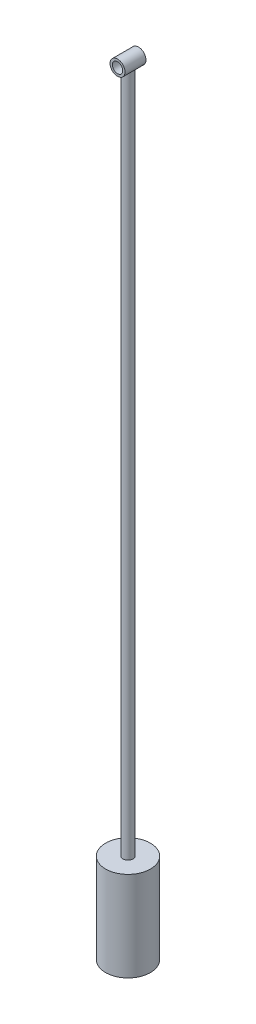
ISO-10303-21;
HEADER;
FILE_DESCRIPTION(('STEP AP214'),'2;1');
FILE_NAME('part.step','',(''),(''),'','','');
FILE_SCHEMA(('AUTOMOTIVE_DESIGN { 1 0 10303 214 1 1 1 1 }'));
ENDSEC;
DATA;
#1=APPLICATION_CONTEXT('core data for automotive mechanical design processes');
#2=APPLICATION_PROTOCOL_DEFINITION('international standard','automotive_design',2000,#1);
#3=PRODUCT_CONTEXT('',#1,'mechanical');
#4=PRODUCT('Part','Part','',(#3));
#5=PRODUCT_RELATED_PRODUCT_CATEGORY('part','',(#4));
#6=PRODUCT_DEFINITION_FORMATION('','',#4);
#7=PRODUCT_DEFINITION_CONTEXT('part definition',#1,'design');
#8=PRODUCT_DEFINITION('design','',#6,#7);
#9=PRODUCT_DEFINITION_SHAPE('','',#8);
#10=(LENGTH_UNIT() NAMED_UNIT(*) SI_UNIT(.MILLI.,.METRE.));
#11=(NAMED_UNIT(*) PLANE_ANGLE_UNIT() SI_UNIT($,.RADIAN.));
#12=(NAMED_UNIT(*) SI_UNIT($,.STERADIAN.) SOLID_ANGLE_UNIT());
#13=UNCERTAINTY_MEASURE_WITH_UNIT(LENGTH_MEASURE(1.E-05),#10,'distance_accuracy_value','');
#14=(GEOMETRIC_REPRESENTATION_CONTEXT(3) GLOBAL_UNCERTAINTY_ASSIGNED_CONTEXT((#13)) GLOBAL_UNIT_ASSIGNED_CONTEXT((#10,
#11,#12)) REPRESENTATION_CONTEXT('',''));
#15=CARTESIAN_POINT('',(0.,0.,0.));
#16=DIRECTION('',(0.,0.,1.));
#17=DIRECTION('',(1.,0.,0.));
#18=AXIS2_PLACEMENT_3D('',#15,#16,#17);
#19=CARTESIAN_POINT('',(39.8920280684704,-163.299740087302,156.422438478742));
#20=DIRECTION('',(0.,1.,0.));
#21=DIRECTION('',(0.,0.,1.));
#22=AXIS2_PLACEMENT_3D('',#19,#20,#21);
#23=CYLINDRICAL_SURFACE('',#22,1.6887208357522);
#24=CARTESIAN_POINT('',(39.8920280684704,74.2002599126983,158.111159314495));
#25=CARTESIAN_POINT('',(39.976612637628,74.2002625874081,158.111156547928));
#26=CARTESIAN_POINT('',(40.0612228038979,74.2045917604956,158.104766330544));
#27=CARTESIAN_POINT('',(40.2277514077067,74.2214876174982,158.079597114953));
#28=CARTESIAN_POINT('',(40.3096676651086,74.2340608088683,158.060808329803));
#29=CARTESIAN_POINT('',(40.4681280845813,74.2662057912873,158.012008207917));
#30=CARTESIAN_POINT('',(40.5446963539942,74.2857433751757,157.98205169158));
#31=CARTESIAN_POINT('',(40.6913897387827,74.33025881423,157.91220573632));
#32=CARTESIAN_POINT('',(40.7615142160435,74.3552372073637,157.872315315111));
#33=CARTESIAN_POINT('',(40.9001352435084,74.4112043935658,157.780016573002));
#34=CARTESIAN_POINT('',(40.9679751249813,74.4425250930014,157.726827559267));
#35=CARTESIAN_POINT('',(41.0943874932657,74.5072285499374,157.611326729492));
#36=CARTESIAN_POINT('',(41.15294624342,74.5406142641131,157.549001649133));
#37=CARTESIAN_POINT('',(41.2688782370093,74.6122851299564,157.405255950271));
#38=CARTESIAN_POINT('',(41.3245109471534,74.6504843860457,157.322378169004));
#39=CARTESIAN_POINT('',(41.4210159484298,74.7214263820811,157.146322458198));
#40=CARTESIAN_POINT('',(41.4619136983701,74.7541784802884,157.053162661217));
#41=CARTESIAN_POINT('',(41.5172604180444,74.800386558033,156.886819582814));
#42=CARTESIAN_POINT('',(41.5359523558711,74.8166846442126,156.815846015788));
#43=CARTESIAN_POINT('',(41.5640097459348,74.8415407511232,156.67080967325));
#44=CARTESIAN_POINT('',(41.5733916732343,74.8501124420663,156.596752597277));
#45=CARTESIAN_POINT('',(41.5822343618601,74.8581835980639,156.447194041568));
#46=CARTESIAN_POINT('',(41.5816503280399,74.8576421011793,156.371687564788));
#47=CARTESIAN_POINT('',(41.5704952090615,74.8474787224149,156.222020029807));
#48=CARTESIAN_POINT('',(41.5599168493546,74.837850226406,156.147859991712));
#49=CARTESIAN_POINT('',(41.5302542954702,74.8117222836305,156.006561935664));
#50=CARTESIAN_POINT('',(41.5116180503782,74.795587352524,155.939258072307));
#51=CARTESIAN_POINT('',(41.4667818829543,74.7583537690049,155.808677698966));
#52=CARTESIAN_POINT('',(41.4405761348258,74.7372512956941,155.745404336974));
#53=CARTESIAN_POINT('',(41.3670509987412,74.6810167768965,155.594084144391));
#54=CARTESIAN_POINT('',(41.3156336108817,74.6440106083456,155.508713033017));
#55=CARTESIAN_POINT('',(41.199172963674,74.5680725040337,155.348674465229));
#56=CARTESIAN_POINT('',(41.1341049236039,74.5291371657079,155.274026896806));
#57=CARTESIAN_POINT('',(40.9906952553025,74.4531343847033,155.136095434023));
#58=CARTESIAN_POINT('',(40.9122508261231,74.4160845353976,155.072908024334));
#59=CARTESIAN_POINT('',(40.7436097063255,74.3480198157479,154.960659503361));
#60=CARTESIAN_POINT('',(40.6534377681361,74.316992568354,154.911569319085));
#61=CARTESIAN_POINT('',(40.4844030408762,74.2702397186524,154.838973930005));
#62=CARTESIAN_POINT('',(40.4074537065628,74.2526473746697,154.812210880942));
#63=CARTESIAN_POINT('',(40.2492733451106,74.224616871511,154.769912984792));
#64=CARTESIAN_POINT('',(40.1680452305534,74.2141739117972,154.754370603073));
#65=CARTESIAN_POINT('',(40.003274578927,74.2013657831073,154.73534031528));
#66=CARTESIAN_POINT('',(39.9197254367932,74.1990267093883,154.73189135069));
#67=CARTESIAN_POINT('',(39.7532192749832,74.2027278433378,154.737372107648));
#68=CARTESIAN_POINT('',(39.6702622960248,74.2087686217402,154.746302672339));
#69=CARTESIAN_POINT('',(39.5116294680162,74.2281422258956,154.775243589595));
#70=CARTESIAN_POINT('',(39.4357975430938,74.2410909664258,154.79467098368));
#71=CARTESIAN_POINT('',(39.2886876181951,74.272987480025,154.843272610918));
#72=CARTESIAN_POINT('',(39.2174104529186,74.291936348903,154.872448624523));
#73=CARTESIAN_POINT('',(39.0749528726145,74.3362792367943,154.942246017698));
#74=CARTESIAN_POINT('',(39.0042661094689,74.3620761609443,154.983613362448));
#75=CARTESIAN_POINT('',(38.8705104028249,74.4173343463494,155.075269414478));
#76=CARTESIAN_POINT('',(38.807447564956,74.4467985066921,155.125565193581));
#77=CARTESIAN_POINT('',(38.6797017462089,74.5125121595906,155.243123037993));
#78=CARTESIAN_POINT('',(38.6164944769797,74.54907503058,155.311815645519));
#79=CARTESIAN_POINT('',(38.5019672180985,74.6212431128478,155.459002846591));
#80=CARTESIAN_POINT('',(38.4506514117191,74.6568479832317,155.537500874665));
#81=CARTESIAN_POINT('',(38.3676603146327,74.7181996721762,155.691310889664));
#82=CARTESIAN_POINT('',(38.3342046938017,74.744625954419,155.765385909923));
#83=CARTESIAN_POINT('',(38.2779028157291,74.7908270055522,155.919381461255));
#84=CARTESIAN_POINT('',(38.2550357739375,74.8106147840782,155.999290181026));
#85=CARTESIAN_POINT('',(38.2238412412668,74.8381319454014,156.150550367512));
#86=CARTESIAN_POINT('',(38.2137994400624,74.8472629745045,156.221286269026));
#87=CARTESIAN_POINT('',(38.2028041493013,74.8572775043992,156.364022585899));
#88=CARTESIAN_POINT('',(38.201843412958,74.8581675815466,156.436021947024));
#89=CARTESIAN_POINT('',(38.2090636658136,74.8515711016665,156.579083307661));
#90=CARTESIAN_POINT('',(38.2172362222817,74.8440922716075,156.650146110644));
#91=CARTESIAN_POINT('',(38.2421792521272,74.8218908429817,156.789606252266));
#92=CARTESIAN_POINT('',(38.2589616087204,74.8071582339097,156.857999765999));
#93=CARTESIAN_POINT('',(38.3071011376079,74.7665362622723,157.012620631584));
#94=CARTESIAN_POINT('',(38.3414291507049,74.7385742397535,157.097370901507));
#95=CARTESIAN_POINT('',(38.4221803494536,74.6773625326478,157.258801671645));
#96=CARTESIAN_POINT('',(38.4686216448017,74.6441049603135,157.335469845852));
#97=CARTESIAN_POINT('',(38.5735280238071,74.5752726251958,157.481478066762));
#98=CARTESIAN_POINT('',(38.6322073358193,74.5396655825482,157.550648656914));
#99=CARTESIAN_POINT('',(38.7603126291656,74.4698913940187,157.679111312811));
#100=CARTESIAN_POINT('',(38.8297414146099,74.4357246268146,157.738400792564));
#101=CARTESIAN_POINT('',(38.9870963783977,74.3680424725349,157.851885344255));
#102=CARTESIAN_POINT('',(39.0762273464895,74.3350403491228,157.904740212885));
#103=CARTESIAN_POINT('',(39.265020292303,74.2781729334729,157.993891182146));
#104=CARTESIAN_POINT('',(39.3646573198911,74.2542865898554,158.030225471948));
#105=CARTESIAN_POINT('',(39.5363604267859,74.2247048175389,158.074806199005));
#106=CARTESIAN_POINT('',(39.6064903560034,74.2155966006494,158.088383555489));
#107=CARTESIAN_POINT('',(39.7484171472583,74.2033741225868,158.106559625236));
#108=CARTESIAN_POINT('',(39.8202133820389,74.2002576417942,158.111161663387));
#109=CARTESIAN_POINT('',(39.8920280684704,74.2002599126983,158.111159314495));
#110=B_SPLINE_CURVE_WITH_KNOTS('',3,(#24,#25,#26,#27,#28,#29,#30,#31,#32,#33,#34,#35,#36,#37,
#38,#39,#40,#41,#42,#43,#44,#45,#46,#47,#48,#49,#50,#51,#52,#53,#54,#55,#56,#57,#58,#59,#60,#61,
#62,#63,#64,#65,#66,#67,#68,#69,#70,#71,#72,#73,#74,#75,#76,#77,#78,#79,#80,#81,#82,#83,#84,#85,
#86,#87,#88,#89,#90,#91,#92,#93,#94,#95,#96,#97,#98,#99,#100,#101,#102,#103,#104,#105,#106,#107,
#108,#109),.UNSPECIFIED.,.T.,.F.,(4,2,2,2,2,2,2,2,2,2,2,2,2,2,2,2,2,2,2,2,2,2,2,2,2,2,2,2,2,2,2,
2,2,2,2,2,2,2,2,2,2,2,4),(0.,0.253460367757198,0.50712104690823,0.759552604635339,
1.01200913323385,1.2861404990165,1.56067388206931,1.87984027424289,2.19845254140141,
2.42311467996334,2.64737854199334,2.87265069295222,3.09808693869585,3.31234071527362,
3.52675983163661,3.84403333070923,4.16188785509944,4.48230540194262,4.80205732009123,
5.05104683174912,5.29986899207966,5.54949164169037,5.79913129340308,6.03615051679426,
6.27321305221175,6.5298440354879,6.78667919931923,7.08624058069696,7.38590718470597,
7.64138669665038,7.89636257400988,8.11147146317152,8.32640867863704,8.54114760730877,
8.75618371845157,9.04150061972844,9.32724654738811,9.61849252115582,9.90981459782513,
10.2341735538835,10.557778857593,10.7730536264165,10.9882486320137),.UNSPECIFIED.);
#111=CARTESIAN_POINT('',(39.8920280684704,74.2002599126983,158.111159314495));
#112=VERTEX_POINT('',#111);
#113=EDGE_CURVE('E52',#112,#112,#110,.T.);
#114=ORIENTED_EDGE('',*,*,#113,.F.);
#115=EDGE_LOOP('',(#114));
#116=FACE_BOUND('',#115,.T.);
#117=CARTESIAN_POINT('',(39.8920280684704,-153.299740087302,156.422438478742));
#118=DIRECTION('',(0.,-1.,0.));
#119=DIRECTION('',(0.,0.,-1.));
#120=AXIS2_PLACEMENT_3D('',#117,#118,#119);
#121=CIRCLE('',#120,1.6887208357522);
#122=CARTESIAN_POINT('',(39.8920280684704,-153.299740087302,154.73371764299));
#123=VERTEX_POINT('',#122);
#124=EDGE_CURVE('E10',#123,#123,#121,.T.);
#125=ORIENTED_EDGE('',*,*,#124,.F.);
#126=EDGE_LOOP('',(#125));
#127=FACE_BOUND('',#126,.T.);
#128=ADVANCED_FACE('F30',(#116,#127),#23,.T.);
#129=CARTESIAN_POINT('',(39.8920280684704,76.7002599126983,152.922438478742));
#130=DIRECTION('',(0.,0.,1.));
#131=DIRECTION('',(1.,0.,0.));
#132=AXIS2_PLACEMENT_3D('',#129,#130,#131);
#133=CYLINDRICAL_SURFACE('',#132,2.50000000000001);
#134=CARTESIAN_POINT('',(39.8920280684704,76.7002599126983,159.922438478742));
#135=DIRECTION('',(0.,0.,1.));
#136=DIRECTION('',(1.,0.,0.));
#137=AXIS2_PLACEMENT_3D('',#134,#135,#136);
#138=CIRCLE('',#137,2.50000000000001);
#139=CARTESIAN_POINT('',(42.3920280684704,76.7002599126983,159.922438478742));
#140=VERTEX_POINT('',#139);
#141=EDGE_CURVE('E42',#140,#140,#138,.T.);
#142=ORIENTED_EDGE('',*,*,#141,.F.);
#143=EDGE_LOOP('',(#142));
#144=FACE_BOUND('',#143,.T.);
#145=CARTESIAN_POINT('',(39.8920280684704,76.7002599126983,152.922438478742));
#146=DIRECTION('',(0.,0.,1.));
#147=DIRECTION('',(1.,0.,0.));
#148=AXIS2_PLACEMENT_3D('',#145,#146,#147);
#149=CIRCLE('',#148,2.50000000000001);
#150=CARTESIAN_POINT('',(42.3920280684704,76.7002599126983,152.922438478742));
#151=VERTEX_POINT('',#150);
#152=EDGE_CURVE('E38',#151,#151,#149,.T.);
#153=ORIENTED_EDGE('',*,*,#152,.T.);
#154=EDGE_LOOP('',(#153));
#155=FACE_BOUND('',#154,.T.);
#156=ORIENTED_EDGE('',*,*,#113,.T.);
#157=EDGE_LOOP('',(#156));
#158=FACE_BOUND('',#157,.T.);
#159=ADVANCED_FACE('F32',(#144,#155,#158),#133,.T.);
#160=CARTESIAN_POINT('',(39.8920280684704,76.7002599126983,152.922438478742));
#161=DIRECTION('',(0.,0.,1.));
#162=DIRECTION('',(1.,0.,0.));
#163=AXIS2_PLACEMENT_3D('',#160,#161,#162);
#164=PLANE('',#163);
#165=CARTESIAN_POINT('',(39.8920280684704,76.7002599126983,152.922438478742));
#166=DIRECTION('',(0.,0.,1.));
#167=DIRECTION('',(1.,0.,0.));
#168=AXIS2_PLACEMENT_3D('',#165,#166,#167);
#169=CIRCLE('',#168,1.73391068690877);
#170=CARTESIAN_POINT('',(41.6259387553792,76.7002599126983,152.922438478742));
#171=VERTEX_POINT('',#170);
#172=EDGE_CURVE('E47',#171,#171,#169,.T.);
#173=ORIENTED_EDGE('',*,*,#172,.T.);
#174=EDGE_LOOP('',(#173));
#175=FACE_BOUND('',#174,.T.);
#176=ORIENTED_EDGE('',*,*,#152,.F.);
#177=EDGE_LOOP('',(#176));
#178=FACE_BOUND('',#177,.T.);
#179=ADVANCED_FACE('F71',(#175,#178),#164,.F.);
#180=CARTESIAN_POINT('',(39.8920280684704,76.7002599126983,159.922438478742));
#181=DIRECTION('',(0.,0.,1.));
#182=DIRECTION('',(1.,0.,0.));
#183=AXIS2_PLACEMENT_3D('',#180,#181,#182);
#184=PLANE('',#183);
#185=CARTESIAN_POINT('',(39.8920280684704,76.7002599126983,159.922438478742));
#186=DIRECTION('',(0.,0.,1.));
#187=DIRECTION('',(1.,0.,0.));
#188=AXIS2_PLACEMENT_3D('',#185,#186,#187);
#189=CIRCLE('',#188,1.73391068690877);
#190=CARTESIAN_POINT('',(41.6259387553792,76.7002599126983,159.922438478742));
#191=VERTEX_POINT('',#190);
#192=EDGE_CURVE('E50',#191,#191,#189,.T.);
#193=ORIENTED_EDGE('',*,*,#192,.F.);
#194=EDGE_LOOP('',(#193));
#195=FACE_BOUND('',#194,.T.);
#196=ORIENTED_EDGE('',*,*,#141,.T.);
#197=EDGE_LOOP('',(#196));
#198=FACE_BOUND('',#197,.T.);
#199=ADVANCED_FACE('F69',(#195,#198),#184,.T.);
#200=CARTESIAN_POINT('',(39.8920280684704,76.7002599126983,152.922438478742));
#201=DIRECTION('',(0.,0.,1.));
#202=DIRECTION('',(1.,0.,0.));
#203=AXIS2_PLACEMENT_3D('',#200,#201,#202);
#204=CYLINDRICAL_SURFACE('',#203,1.73391068690877);
#205=ORIENTED_EDGE('',*,*,#172,.F.);
#206=EDGE_LOOP('',(#205));
#207=FACE_BOUND('',#206,.T.);
#208=ORIENTED_EDGE('',*,*,#192,.T.);
#209=EDGE_LOOP('',(#208));
#210=FACE_BOUND('',#209,.T.);
#211=ADVANCED_FACE('F66',(#207,#210),#204,.F.);
#212=CARTESIAN_POINT('',(39.8920280684704,-153.299740087302,156.422438478742));
#213=DIRECTION('',(0.,-1.,0.));
#214=DIRECTION('',(0.,0.,-1.));
#215=AXIS2_PLACEMENT_3D('',#212,#213,#214);
#216=CYLINDRICAL_SURFACE('',#215,7.5);
#217=CARTESIAN_POINT('',(39.8920280684704,-153.299740087302,156.422438478742));
#218=DIRECTION('',(0.,-1.,0.));
#219=DIRECTION('',(0.,0.,-1.));
#220=AXIS2_PLACEMENT_3D('',#217,#218,#219);
#221=CIRCLE('',#220,7.5);
#222=CARTESIAN_POINT('',(39.8920280684704,-153.299740087302,148.922438478742));
#223=VERTEX_POINT('',#222);
#224=EDGE_CURVE('E58',#223,#223,#221,.T.);
#225=ORIENTED_EDGE('',*,*,#224,.T.);
#226=EDGE_LOOP('',(#225));
#227=FACE_BOUND('',#226,.T.);
#228=CARTESIAN_POINT('',(39.8920280684704,-183.299740087302,156.422438478742));
#229=DIRECTION('',(0.,-1.,0.));
#230=DIRECTION('',(0.,0.,-1.));
#231=AXIS2_PLACEMENT_3D('',#228,#229,#230);
#232=CIRCLE('',#231,7.5);
#233=CARTESIAN_POINT('',(39.8920280684704,-183.299740087302,148.922438478742));
#234=VERTEX_POINT('',#233);
#235=EDGE_CURVE('E143',#234,#234,#232,.T.);
#236=ORIENTED_EDGE('',*,*,#235,.F.);
#237=EDGE_LOOP('',(#236));
#238=FACE_BOUND('',#237,.T.);
#239=ADVANCED_FACE('F64',(#227,#238),#216,.T.);
#240=CARTESIAN_POINT('',(39.8920280684704,-153.299740087302,156.422438478742));
#241=DIRECTION('',(0.,-1.,0.));
#242=DIRECTION('',(0.,0.,-1.));
#243=AXIS2_PLACEMENT_3D('',#240,#241,#242);
#244=PLANE('',#243);
#245=ORIENTED_EDGE('',*,*,#124,.T.);
#246=EDGE_LOOP('',(#245));
#247=FACE_BOUND('',#246,.T.);
#248=ORIENTED_EDGE('',*,*,#224,.F.);
#249=EDGE_LOOP('',(#248));
#250=FACE_BOUND('',#249,.T.);
#251=ADVANCED_FACE('F113',(#247,#250),#244,.F.);
#252=CARTESIAN_POINT('',(39.8920280684704,-183.299740087302,156.422438478742));
#253=DIRECTION('',(0.,-1.,0.));
#254=DIRECTION('',(0.,0.,-1.));
#255=AXIS2_PLACEMENT_3D('',#252,#253,#254);
#256=PLANE('',#255);
#257=ORIENTED_EDGE('',*,*,#235,.T.);
#258=EDGE_LOOP('',(#257));
#259=FACE_BOUND('',#258,.T.);
#260=ADVANCED_FACE('F120',(#259),#256,.T.);
#261=CLOSED_SHELL('',(#128,#159,#179,#199,#211,#239,#251,#260));
#262=MANIFOLD_SOLID_BREP('B2',#261);
#263=ADVANCED_BREP_SHAPE_REPRESENTATION('',(#18,#262),#14);
#264=SHAPE_DEFINITION_REPRESENTATION(#9,#263);
ENDSEC;
END-ISO-10303-21;
